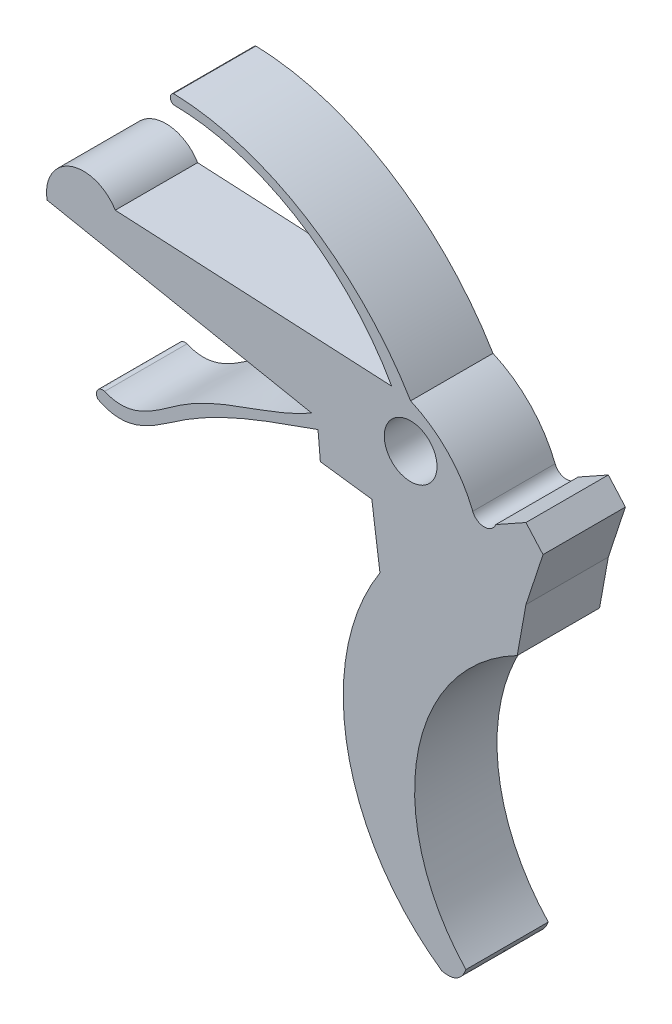
ISO-10303-21;
HEADER;
FILE_DESCRIPTION(('STEP AP214'),'2;1');
FILE_NAME('part.step','',(''),(''),'','','');
FILE_SCHEMA(('AUTOMOTIVE_DESIGN { 1 0 10303 214 1 1 1 1 }'));
ENDSEC;
DATA;
#1=APPLICATION_CONTEXT('core data for automotive mechanical design processes');
#2=APPLICATION_PROTOCOL_DEFINITION('international standard','automotive_design',2000,#1);
#3=PRODUCT_CONTEXT('',#1,'mechanical');
#4=PRODUCT('Part','Part','',(#3));
#5=PRODUCT_RELATED_PRODUCT_CATEGORY('part','',(#4));
#6=PRODUCT_DEFINITION_FORMATION('','',#4);
#7=PRODUCT_DEFINITION_CONTEXT('part definition',#1,'design');
#8=PRODUCT_DEFINITION('design','',#6,#7);
#9=PRODUCT_DEFINITION_SHAPE('','',#8);
#10=(LENGTH_UNIT() NAMED_UNIT(*) SI_UNIT(.MILLI.,.METRE.));
#11=(NAMED_UNIT(*) PLANE_ANGLE_UNIT() SI_UNIT($,.RADIAN.));
#12=(NAMED_UNIT(*) SI_UNIT($,.STERADIAN.) SOLID_ANGLE_UNIT());
#13=UNCERTAINTY_MEASURE_WITH_UNIT(LENGTH_MEASURE(1.E-05),#10,'distance_accuracy_value','');
#14=(GEOMETRIC_REPRESENTATION_CONTEXT(3) GLOBAL_UNCERTAINTY_ASSIGNED_CONTEXT((#13)) GLOBAL_UNIT_ASSIGNED_CONTEXT((#10,
#11,#12)) REPRESENTATION_CONTEXT('',''));
#15=CARTESIAN_POINT('',(0.,0.,0.));
#16=DIRECTION('',(0.,0.,1.));
#17=DIRECTION('',(1.,0.,0.));
#18=AXIS2_PLACEMENT_3D('',#15,#16,#17);
#19=CARTESIAN_POINT('',(37.3818337349311,23.7795758138478,5.));
#20=DIRECTION('',(0.,0.,-1.));
#21=DIRECTION('',(-1.,0.,0.));
#22=AXIS2_PLACEMENT_3D('',#19,#20,#21);
#23=CYLINDRICAL_SURFACE('',#22,7.14654999473033);
#24=CARTESIAN_POINT('',(37.3818337349311,23.7795758138478,0.));
#25=DIRECTION('',(0.,0.,1.));
#26=DIRECTION('',(1.,0.,0.));
#27=AXIS2_PLACEMENT_3D('',#24,#25,#26);
#28=CIRCLE('',#27,7.14654999473033);
#29=CARTESIAN_POINT('',(44.0293534154959,26.4032486066488,0.));
#30=VERTEX_POINT('',#29);
#31=CARTESIAN_POINT('',(40.2574429635764,30.322056107384,0.));
#32=VERTEX_POINT('',#31);
#33=EDGE_CURVE('E215',#30,#32,#28,.T.);
#34=ORIENTED_EDGE('',*,*,#33,.T.);
#35=DIRECTION('',(0.,0.,-1.));
#36=VECTOR('',#35,1.);
#37=CARTESIAN_POINT('',(40.2574429635764,30.322056107384,5.));
#38=LINE('',#37,#36);
#39=CARTESIAN_POINT('',(40.2574429635764,30.322056107384,5.));
#40=VERTEX_POINT('',#39);
#41=EDGE_CURVE('E11',#40,#32,#38,.T.);
#42=ORIENTED_EDGE('',*,*,#41,.F.);
#43=CARTESIAN_POINT('',(37.3818337349311,23.7795758138478,5.));
#44=DIRECTION('',(0.,0.,1.));
#45=DIRECTION('',(1.,0.,0.));
#46=AXIS2_PLACEMENT_3D('',#43,#44,#45);
#47=CIRCLE('',#46,7.14654999473033);
#48=CARTESIAN_POINT('',(44.0293534154959,26.4032486066488,5.));
#49=VERTEX_POINT('',#48);
#50=EDGE_CURVE('E377',#49,#40,#47,.T.);
#51=ORIENTED_EDGE('',*,*,#50,.F.);
#52=DIRECTION('',(0.,0.,-1.));
#53=VECTOR('',#52,1.);
#54=CARTESIAN_POINT('',(44.0293534154959,26.4032486066488,5.));
#55=LINE('',#54,#53);
#56=EDGE_CURVE('E53',#49,#30,#55,.T.);
#57=ORIENTED_EDGE('',*,*,#56,.T.);
#58=EDGE_LOOP('',(#34,#42,#51,#57));
#59=FACE_BOUND('',#58,.T.);
#60=ADVANCED_FACE('F36',(#59),#23,.T.);
#61=CARTESIAN_POINT('',(40.2574429635764,30.322056107384,5.));
#62=CARTESIAN_POINT('',(37.2545948761089,35.3386603093934,5.));
#63=CARTESIAN_POINT('',(31.8347830823189,39.1180125760632,5.));
#64=CARTESIAN_POINT('',(25.8602131568734,39.2785286389903,5.));
#65=B_SPLINE_CURVE_WITH_KNOTS('',3,(#61,#62,#63,#64),.UNSPECIFIED.,.F.,.F.,(4,4),(0.,1.),.UNSPECIFIED.);
#66=DIRECTION('',(0.,0.,-1.));
#67=VECTOR('',#66,1.);
#68=SURFACE_OF_LINEAR_EXTRUSION('',#65,#67);
#69=CARTESIAN_POINT('',(40.2574429635764,30.322056107384,0.));
#70=CARTESIAN_POINT('',(37.2545948761089,35.3386603093934,0.));
#71=CARTESIAN_POINT('',(31.8347830823189,39.1180125760632,0.));
#72=CARTESIAN_POINT('',(25.8602131568734,39.2785286389903,0.));
#73=B_SPLINE_CURVE_WITH_KNOTS('',3,(#69,#70,#71,#72),.UNSPECIFIED.,.F.,.F.,(4,4),(0.,1.),.UNSPECIFIED.);
#74=CARTESIAN_POINT('',(25.8602131568734,39.2785286389903,0.));
#75=VERTEX_POINT('',#74);
#76=EDGE_CURVE('E217',#32,#75,#73,.T.);
#77=ORIENTED_EDGE('',*,*,#76,.T.);
#78=DIRECTION('',(0.,0.,-1.));
#79=VECTOR('',#78,1.);
#80=CARTESIAN_POINT('',(25.8602131568734,39.2785286389903,5.));
#81=LINE('',#80,#79);
#82=CARTESIAN_POINT('',(25.8602131568734,39.2785286389903,5.));
#83=VERTEX_POINT('',#82);
#84=EDGE_CURVE('E45',#83,#75,#81,.T.);
#85=ORIENTED_EDGE('',*,*,#84,.F.);
#86=EDGE_CURVE('E130',#40,#83,#65,.T.);
#87=ORIENTED_EDGE('',*,*,#86,.F.);
#88=ORIENTED_EDGE('',*,*,#41,.T.);
#89=EDGE_LOOP('',(#77,#85,#87,#88));
#90=FACE_BOUND('',#89,.T.);
#91=ADVANCED_FACE('F371',(#90),#68,.F.);
#92=CARTESIAN_POINT('',(25.9867350178914,38.9856572484438,5.));
#93=DIRECTION('',(0.,0.,-1.));
#94=DIRECTION('',(-1.,0.,0.));
#95=AXIS2_PLACEMENT_3D('',#92,#93,#94);
#96=CYLINDRICAL_SURFACE('',#95,0.319032024593247);
#97=CARTESIAN_POINT('',(25.9867350178914,38.9856572484438,0.));
#98=DIRECTION('',(0.,0.,1.));
#99=DIRECTION('',(1.,0.,0.));
#100=AXIS2_PLACEMENT_3D('',#97,#98,#99);
#101=CIRCLE('',#100,0.319032024593247);
#102=CARTESIAN_POINT('',(25.8602131568734,38.6927858578974,0.));
#103=VERTEX_POINT('',#102);
#104=EDGE_CURVE('E221',#75,#103,#101,.T.);
#105=ORIENTED_EDGE('',*,*,#104,.T.);
#106=DIRECTION('',(0.,0.,-1.));
#107=VECTOR('',#106,1.);
#108=CARTESIAN_POINT('',(25.8602131568734,38.6927858578974,5.));
#109=LINE('',#108,#107);
#110=CARTESIAN_POINT('',(25.8602131568734,38.6927858578974,5.));
#111=VERTEX_POINT('',#110);
#112=EDGE_CURVE('E330',#111,#103,#109,.T.);
#113=ORIENTED_EDGE('',*,*,#112,.F.);
#114=CARTESIAN_POINT('',(25.9867350178914,38.9856572484438,5.));
#115=DIRECTION('',(0.,0.,1.));
#116=DIRECTION('',(1.,0.,0.));
#117=AXIS2_PLACEMENT_3D('',#114,#115,#116);
#118=CIRCLE('',#117,0.319032024593247);
#119=EDGE_CURVE('E337',#83,#111,#118,.T.);
#120=ORIENTED_EDGE('',*,*,#119,.F.);
#121=ORIENTED_EDGE('',*,*,#84,.T.);
#122=EDGE_LOOP('',(#105,#113,#120,#121));
#123=FACE_BOUND('',#122,.T.);
#124=ADVANCED_FACE('F335',(#123),#96,.T.);
#125=CARTESIAN_POINT('',(39.110435040759,30.5197055701568,5.));
#126=CARTESIAN_POINT('',(36.470361769885,35.234015670945,5.));
#127=CARTESIAN_POINT('',(31.363758289211,38.6342021007757,5.));
#128=CARTESIAN_POINT('',(25.8602131568734,38.6927858578974,5.));
#129=B_SPLINE_CURVE_WITH_KNOTS('',3,(#125,#126,#127,#128),.UNSPECIFIED.,.F.,.F.,(4,4),(0.,1.),.UNSPECIFIED.);
#130=DIRECTION('',(0.,0.,-1.));
#131=VECTOR('',#130,1.);
#132=SURFACE_OF_LINEAR_EXTRUSION('',#129,#131);
#133=CARTESIAN_POINT('',(39.110435040759,30.5197055701568,0.));
#134=CARTESIAN_POINT('',(36.470361769885,35.234015670945,0.));
#135=CARTESIAN_POINT('',(31.363758289211,38.6342021007757,0.));
#136=CARTESIAN_POINT('',(25.8602131568734,38.6927858578974,0.));
#137=B_SPLINE_CURVE_WITH_KNOTS('',3,(#133,#134,#135,#136),.UNSPECIFIED.,.F.,.F.,(4,4),(0.,1.),.UNSPECIFIED.);
#138=CARTESIAN_POINT('',(39.110435040759,30.5197055701568,0.));
#139=VERTEX_POINT('',#138);
#140=EDGE_CURVE('E227',#139,#103,#137,.T.);
#141=ORIENTED_EDGE('',*,*,#140,.F.);
#142=DIRECTION('',(0.,0.,-1.));
#143=VECTOR('',#142,1.);
#144=CARTESIAN_POINT('',(39.110435040759,30.5197055701568,5.));
#145=LINE('',#144,#143);
#146=CARTESIAN_POINT('',(39.110435040759,30.5197055701568,5.));
#147=VERTEX_POINT('',#146);
#148=EDGE_CURVE('E328',#147,#139,#145,.T.);
#149=ORIENTED_EDGE('',*,*,#148,.F.);
#150=EDGE_CURVE('E347',#147,#111,#129,.T.);
#151=ORIENTED_EDGE('',*,*,#150,.T.);
#152=ORIENTED_EDGE('',*,*,#112,.T.);
#153=EDGE_LOOP('',(#141,#149,#151,#152));
#154=FACE_BOUND('',#153,.T.);
#155=ADVANCED_FACE('F344',(#154),#132,.T.);
#156=CARTESIAN_POINT('',(1.6619992772925,32.4383969666114,5.));
#157=DIRECTION('',(0.0511684385078754,0.998690037449391,0.));
#158=DIRECTION('',(-0.998690037449391,0.0511684385078754,0.));
#159=AXIS2_PLACEMENT_3D('',#156,#157,#158);
#160=PLANE('',#159);
#161=DIRECTION('',(0.998690037449391,-0.0511684385078754,0.));
#162=VECTOR('',#161,1.);
#163=CARTESIAN_POINT('',(1.6619992772925,32.4383969666114,0.));
#164=LINE('',#163,#162);
#165=CARTESIAN_POINT('',(22.327201908344,31.3796038371832,0.));
#166=VERTEX_POINT('',#165);
#167=EDGE_CURVE('E232',#166,#139,#164,.T.);
#168=ORIENTED_EDGE('',*,*,#167,.F.);
#169=DIRECTION('',(0.,0.,-1.));
#170=VECTOR('',#169,1.);
#171=CARTESIAN_POINT('',(22.327201908344,31.3796038371832,5.));
#172=LINE('',#171,#170);
#173=CARTESIAN_POINT('',(22.327201908344,31.3796038371832,5.));
#174=VERTEX_POINT('',#173);
#175=EDGE_CURVE('E326',#174,#166,#172,.T.);
#176=ORIENTED_EDGE('',*,*,#175,.F.);
#177=DIRECTION('',(0.998690037449391,-0.0511684385078754,0.));
#178=VECTOR('',#177,1.);
#179=CARTESIAN_POINT('',(1.6619992772925,32.4383969666114,5.));
#180=LINE('',#179,#178);
#181=EDGE_CURVE('E350',#174,#147,#180,.T.);
#182=ORIENTED_EDGE('',*,*,#181,.T.);
#183=ORIENTED_EDGE('',*,*,#148,.T.);
#184=EDGE_LOOP('',(#168,#176,#182,#183));
#185=FACE_BOUND('',#184,.T.);
#186=ADVANCED_FACE('F367',(#185),#160,.T.);
#187=CARTESIAN_POINT('',(20.4014032915097,30.2309320198475,5.));
#188=DIRECTION('',(0.,0.,-1.));
#189=DIRECTION('',(-1.,0.,0.));
#190=AXIS2_PLACEMENT_3D('',#187,#188,#189);
#191=CYLINDRICAL_SURFACE('',#190,2.24235306241949);
#192=CARTESIAN_POINT('',(20.4014032915097,30.2309320198475,0.));
#193=DIRECTION('',(0.,0.,1.));
#194=DIRECTION('',(1.,0.,0.));
#195=AXIS2_PLACEMENT_3D('',#192,#193,#194);
#196=CIRCLE('',#195,2.24235306241949);
#197=CARTESIAN_POINT('',(18.1931516918561,29.8413525938389,0.));
#198=VERTEX_POINT('',#197);
#199=EDGE_CURVE('E238',#166,#198,#196,.T.);
#200=ORIENTED_EDGE('',*,*,#199,.T.);
#201=DIRECTION('',(0.,0.,-1.));
#202=VECTOR('',#201,1.);
#203=CARTESIAN_POINT('',(18.1931516918561,29.8413525938389,5.));
#204=LINE('',#203,#202);
#205=CARTESIAN_POINT('',(18.1931516918561,29.8413525938389,5.));
#206=VERTEX_POINT('',#205);
#207=EDGE_CURVE('E323',#206,#198,#204,.T.);
#208=ORIENTED_EDGE('',*,*,#207,.F.);
#209=CARTESIAN_POINT('',(20.4014032915097,30.2309320198475,5.));
#210=DIRECTION('',(0.,0.,1.));
#211=DIRECTION('',(1.,0.,0.));
#212=AXIS2_PLACEMENT_3D('',#209,#210,#211);
#213=CIRCLE('',#212,2.24235306241949);
#214=EDGE_CURVE('E352',#174,#206,#213,.T.);
#215=ORIENTED_EDGE('',*,*,#214,.F.);
#216=ORIENTED_EDGE('',*,*,#175,.T.);
#217=EDGE_LOOP('',(#200,#208,#215,#216));
#218=FACE_BOUND('',#217,.T.);
#219=ADVANCED_FACE('F472',(#218),#191,.T.);
#220=CARTESIAN_POINT('',(6.33637133537671,32.1762708777534,5.));
#221=DIRECTION('',(0.19321599860004,0.981156245398759,0.));
#222=DIRECTION('',(-0.981156245398759,0.19321599860004,0.));
#223=AXIS2_PLACEMENT_3D('',#220,#221,#222);
#224=PLANE('',#223);
#225=DIRECTION('',(0.981156245398759,-0.19321599860004,0.));
#226=VECTOR('',#225,1.);
#227=CARTESIAN_POINT('',(6.33637133537671,32.1762708777534,0.));
#228=LINE('',#227,#226);
#229=CARTESIAN_POINT('',(34.2534981984501,26.678639312762,0.));
#230=VERTEX_POINT('',#229);
#231=EDGE_CURVE('E240',#198,#230,#228,.T.);
#232=ORIENTED_EDGE('',*,*,#231,.T.);
#233=DIRECTION('',(0.,0.,-1.));
#234=VECTOR('',#233,1.);
#235=CARTESIAN_POINT('',(34.2534981984501,26.678639312762,5.));
#236=LINE('',#235,#234);
#237=CARTESIAN_POINT('',(34.2534981984501,26.678639312762,5.));
#238=VERTEX_POINT('',#237);
#239=EDGE_CURVE('E320',#238,#230,#236,.T.);
#240=ORIENTED_EDGE('',*,*,#239,.F.);
#241=DIRECTION('',(0.981156245398759,-0.19321599860004,0.));
#242=VECTOR('',#241,1.);
#243=CARTESIAN_POINT('',(6.33637133537671,32.1762708777534,5.));
#244=LINE('',#243,#242);
#245=EDGE_CURVE('E467',#206,#238,#244,.T.);
#246=ORIENTED_EDGE('',*,*,#245,.F.);
#247=ORIENTED_EDGE('',*,*,#207,.T.);
#248=EDGE_LOOP('',(#232,#240,#246,#247));
#249=FACE_BOUND('',#248,.T.);
#250=ADVANCED_FACE('F466',(#249),#224,.F.);
#251=CARTESIAN_POINT('',(34.2534981984501,26.678639312762,5.));
#252=CARTESIAN_POINT('',(31.6637874763804,25.1921338439413,5.));
#253=CARTESIAN_POINT('',(27.2829957958831,24.6024625937999,5.));
#254=CARTESIAN_POINT('',(23.4719266528236,20.7844869531401,5.));
#255=CARTESIAN_POINT('',(21.6844335803834,21.5348725030533,5.));
#256=B_SPLINE_CURVE_WITH_KNOTS('',3,(#251,#252,#253,#254,#255),.UNSPECIFIED.,.F.,.F.,(4,1,4),
(0.,0.618454584909698,1.),.UNSPECIFIED.);
#257=DIRECTION('',(0.,0.,-1.));
#258=VECTOR('',#257,1.);
#259=SURFACE_OF_LINEAR_EXTRUSION('',#256,#258);
#260=CARTESIAN_POINT('',(34.2534981984501,26.678639312762,0.));
#261=CARTESIAN_POINT('',(31.6637874763804,25.1921338439413,0.));
#262=CARTESIAN_POINT('',(27.2829957958831,24.6024625937999,0.));
#263=CARTESIAN_POINT('',(23.4719266528236,20.7844869531401,0.));
#264=CARTESIAN_POINT('',(21.6844335803834,21.5348725030533,0.));
#265=B_SPLINE_CURVE_WITH_KNOTS('',3,(#260,#261,#262,#263,#264),.UNSPECIFIED.,.F.,.F.,(4,1,4),
(0.,0.618454584909698,1.),.UNSPECIFIED.);
#266=CARTESIAN_POINT('',(21.6844335803834,21.5348725030533,0.));
#267=VERTEX_POINT('',#266);
#268=EDGE_CURVE('E242',#230,#267,#265,.T.);
#269=ORIENTED_EDGE('',*,*,#268,.T.);
#270=DIRECTION('',(0.,0.,-1.));
#271=VECTOR('',#270,1.);
#272=CARTESIAN_POINT('',(21.6844335803834,21.5348725030533,5.));
#273=LINE('',#272,#271);
#274=CARTESIAN_POINT('',(21.6844335803834,21.5348725030533,5.));
#275=VERTEX_POINT('',#274);
#276=EDGE_CURVE('E317',#275,#267,#273,.T.);
#277=ORIENTED_EDGE('',*,*,#276,.F.);
#278=EDGE_CURVE('E462',#238,#275,#256,.T.);
#279=ORIENTED_EDGE('',*,*,#278,.F.);
#280=ORIENTED_EDGE('',*,*,#239,.T.);
#281=EDGE_LOOP('',(#269,#277,#279,#280));
#282=FACE_BOUND('',#281,.T.);
#283=ADVANCED_FACE('F461',(#282),#259,.F.);
#284=CARTESIAN_POINT('',(21.5657637111525,21.1714144072318,5.));
#285=DIRECTION('',(0.,0.,-1.));
#286=DIRECTION('',(-1.,0.,0.));
#287=AXIS2_PLACEMENT_3D('',#284,#285,#286);
#288=CYLINDRICAL_SURFACE('',#287,0.382340588064524);
#289=CARTESIAN_POINT('',(21.5657637111525,21.1714144072318,0.));
#290=DIRECTION('',(0.,0.,1.));
#291=DIRECTION('',(1.,0.,0.));
#292=AXIS2_PLACEMENT_3D('',#289,#290,#291);
#293=CIRCLE('',#292,0.382340588064524);
#294=CARTESIAN_POINT('',(21.2795499589186,20.9179069846308,0.));
#295=VERTEX_POINT('',#294);
#296=EDGE_CURVE('E246',#267,#295,#293,.T.);
#297=ORIENTED_EDGE('',*,*,#296,.T.);
#298=DIRECTION('',(0.,0.,-1.));
#299=VECTOR('',#298,1.);
#300=CARTESIAN_POINT('',(21.2795499589186,20.9179069846308,5.));
#301=LINE('',#300,#299);
#302=CARTESIAN_POINT('',(21.2795499589186,20.9179069846308,5.));
#303=VERTEX_POINT('',#302);
#304=EDGE_CURVE('E315',#303,#295,#301,.T.);
#305=ORIENTED_EDGE('',*,*,#304,.F.);
#306=CARTESIAN_POINT('',(21.5657637111525,21.1714144072318,5.));
#307=DIRECTION('',(0.,0.,1.));
#308=DIRECTION('',(1.,0.,0.));
#309=AXIS2_PLACEMENT_3D('',#306,#307,#308);
#310=CIRCLE('',#309,0.382340588064524);
#311=EDGE_CURVE('E458',#275,#303,#310,.T.);
#312=ORIENTED_EDGE('',*,*,#311,.F.);
#313=ORIENTED_EDGE('',*,*,#276,.T.);
#314=EDGE_LOOP('',(#297,#305,#312,#313));
#315=FACE_BOUND('',#314,.T.);
#316=ADVANCED_FACE('F455',(#315),#288,.T.);
#317=CARTESIAN_POINT('',(34.6368329298013,26.0047111622717,5.));
#318=CARTESIAN_POINT('',(31.6672221262085,24.9414673210866,5.));
#319=CARTESIAN_POINT('',(27.3105156230599,23.52490171578,5.));
#320=CARTESIAN_POINT('',(23.1726418907745,19.9220567977232,5.));
#321=CARTESIAN_POINT('',(21.2795499589186,20.9179069846308,5.));
#322=B_SPLINE_CURVE_WITH_KNOTS('',3,(#317,#318,#319,#320,#321),.UNSPECIFIED.,.F.,.F.,(4,1,4),
(0.,0.624834993908193,1.),.UNSPECIFIED.);
#323=DIRECTION('',(0.,0.,-1.));
#324=VECTOR('',#323,1.);
#325=SURFACE_OF_LINEAR_EXTRUSION('',#322,#324);
#326=CARTESIAN_POINT('',(34.6368329298013,26.0047111622717,0.));
#327=CARTESIAN_POINT('',(31.6672221262085,24.9414673210866,0.));
#328=CARTESIAN_POINT('',(27.3105156230599,23.52490171578,0.));
#329=CARTESIAN_POINT('',(23.1726418907745,19.9220567977232,0.));
#330=CARTESIAN_POINT('',(21.2795499589186,20.9179069846308,0.));
#331=B_SPLINE_CURVE_WITH_KNOTS('',3,(#326,#327,#328,#329,#330),.UNSPECIFIED.,.F.,.F.,(4,1,4),
(0.,0.624834993908193,1.),.UNSPECIFIED.);
#332=CARTESIAN_POINT('',(34.6368329298013,26.0047111622717,0.));
#333=VERTEX_POINT('',#332);
#334=EDGE_CURVE('E252',#333,#295,#331,.T.);
#335=ORIENTED_EDGE('',*,*,#334,.F.);
#336=DIRECTION('',(0.,0.,-1.));
#337=VECTOR('',#336,1.);
#338=CARTESIAN_POINT('',(34.6368329298013,26.0047111622717,5.));
#339=LINE('',#338,#337);
#340=CARTESIAN_POINT('',(34.6368329298013,26.0047111622717,5.));
#341=VERTEX_POINT('',#340);
#342=EDGE_CURVE('E313',#341,#333,#339,.T.);
#343=ORIENTED_EDGE('',*,*,#342,.F.);
#344=EDGE_CURVE('E449',#341,#303,#322,.T.);
#345=ORIENTED_EDGE('',*,*,#344,.T.);
#346=ORIENTED_EDGE('',*,*,#304,.T.);
#347=EDGE_LOOP('',(#335,#343,#345,#346));
#348=FACE_BOUND('',#347,.T.);
#349=ADVANCED_FACE('F448',(#348),#325,.T.);
#350=CARTESIAN_POINT('',(36.6185248319001,3.17918824406419,5.));
#351=DIRECTION('',(0.996252392469126,0.0864937598878781,0.));
#352=DIRECTION('',(-0.0864937598878781,0.996252392469126,0.));
#353=AXIS2_PLACEMENT_3D('',#350,#351,#352);
#354=PLANE('',#353);
#355=DIRECTION('',(0.0864937598878781,-0.996252392469126,0.));
#356=VECTOR('',#355,1.);
#357=CARTESIAN_POINT('',(36.6185248319001,3.17918824406419,0.));
#358=LINE('',#357,#356);
#359=CARTESIAN_POINT('',(34.7774229091622,24.385367715102,0.));
#360=VERTEX_POINT('',#359);
#361=EDGE_CURVE('E257',#333,#360,#358,.T.);
#362=ORIENTED_EDGE('',*,*,#361,.T.);
#363=DIRECTION('',(0.,0.,-1.));
#364=VECTOR('',#363,1.);
#365=CARTESIAN_POINT('',(34.7774229091622,24.385367715102,5.));
#366=LINE('',#365,#364);
#367=CARTESIAN_POINT('',(34.7774229091622,24.385367715102,5.));
#368=VERTEX_POINT('',#367);
#369=EDGE_CURVE('E310',#368,#360,#366,.T.);
#370=ORIENTED_EDGE('',*,*,#369,.F.);
#371=DIRECTION('',(0.0864937598878781,-0.996252392469126,0.));
#372=VECTOR('',#371,1.);
#373=CARTESIAN_POINT('',(36.6185248319001,3.17918824406419,5.));
#374=LINE('',#373,#372);
#375=EDGE_CURVE('E444',#341,#368,#374,.T.);
#376=ORIENTED_EDGE('',*,*,#375,.F.);
#377=ORIENTED_EDGE('',*,*,#342,.T.);
#378=EDGE_LOOP('',(#362,#370,#376,#377));
#379=FACE_BOUND('',#378,.T.);
#380=ADVANCED_FACE('F443',(#379),#354,.F.);
#381=CARTESIAN_POINT('',(3.71995682536061,28.4467286645222,5.));
#382=DIRECTION('',(0.129665254140665,0.991557825781551,0.));
#383=DIRECTION('',(-0.991557825781551,0.129665254140665,0.));
#384=AXIS2_PLACEMENT_3D('',#381,#382,#383);
#385=PLANE('',#384);
#386=DIRECTION('',(0.991557825781551,-0.129665254140665,0.));
#387=VECTOR('',#386,1.);
#388=CARTESIAN_POINT('',(3.71995682536061,28.4467286645222,0.));
#389=LINE('',#388,#387);
#390=CARTESIAN_POINT('',(37.9019957472054,23.9767697285886,0.));
#391=VERTEX_POINT('',#390);
#392=EDGE_CURVE('E262',#360,#391,#389,.T.);
#393=ORIENTED_EDGE('',*,*,#392,.T.);
#394=DIRECTION('',(0.,0.,-1.));
#395=VECTOR('',#394,1.);
#396=CARTESIAN_POINT('',(37.9019957472054,23.9767697285886,5.));
#397=LINE('',#396,#395);
#398=CARTESIAN_POINT('',(37.9019957472054,23.9767697285886,5.));
#399=VERTEX_POINT('',#398);
#400=EDGE_CURVE('E307',#399,#391,#397,.T.);
#401=ORIENTED_EDGE('',*,*,#400,.F.);
#402=DIRECTION('',(0.991557825781551,-0.129665254140665,0.));
#403=VECTOR('',#402,1.);
#404=CARTESIAN_POINT('',(3.71995682536061,28.4467286645222,5.));
#405=LINE('',#404,#403);
#406=EDGE_CURVE('E440',#368,#399,#405,.T.);
#407=ORIENTED_EDGE('',*,*,#406,.F.);
#408=ORIENTED_EDGE('',*,*,#369,.T.);
#409=EDGE_LOOP('',(#393,#401,#407,#408));
#410=FACE_BOUND('',#409,.T.);
#411=ADVANCED_FACE('F437',(#410),#385,.F.);
#412=CARTESIAN_POINT('',(40.4144228043435,5.4935344193503,5.));
#413=DIRECTION('',(0.990887595677202,0.134691398140541,0.));
#414=DIRECTION('',(-0.134691398140541,0.990887595677202,0.));
#415=AXIS2_PLACEMENT_3D('',#412,#413,#414);
#416=PLANE('',#415);
#417=DIRECTION('',(0.134691398140541,-0.990887595677202,0.));
#418=VECTOR('',#417,1.);
#419=CARTESIAN_POINT('',(40.4144228043435,5.4935344193503,0.));
#420=LINE('',#419,#418);
#421=CARTESIAN_POINT('',(38.3951975521026,20.3484196083502,0.));
#422=VERTEX_POINT('',#421);
#423=EDGE_CURVE('E264',#391,#422,#420,.T.);
#424=ORIENTED_EDGE('',*,*,#423,.T.);
#425=DIRECTION('',(0.,0.,-1.));
#426=VECTOR('',#425,1.);
#427=CARTESIAN_POINT('',(38.3951975521026,20.3484196083502,5.));
#428=LINE('',#427,#426);
#429=CARTESIAN_POINT('',(38.3951975521026,20.3484196083502,5.));
#430=VERTEX_POINT('',#429);
#431=EDGE_CURVE('E304',#430,#422,#428,.T.);
#432=ORIENTED_EDGE('',*,*,#431,.F.);
#433=DIRECTION('',(0.134691398140541,-0.990887595677202,0.));
#434=VECTOR('',#433,1.);
#435=CARTESIAN_POINT('',(40.4144228043435,5.4935344193503,5.));
#436=LINE('',#435,#434);
#437=EDGE_CURVE('E431',#399,#430,#436,.T.);
#438=ORIENTED_EDGE('',*,*,#437,.F.);
#439=ORIENTED_EDGE('',*,*,#400,.T.);
#440=EDGE_LOOP('',(#424,#432,#438,#439));
#441=FACE_BOUND('',#440,.T.);
#442=ADVANCED_FACE('F430',(#441),#416,.F.);
#443=CARTESIAN_POINT('',(50.154117951621,12.7771348691759,5.));
#444=DIRECTION('',(0.,0.,-1.));
#445=DIRECTION('',(-1.,0.,0.));
#446=AXIS2_PLACEMENT_3D('',#443,#444,#445);
#447=CYLINDRICAL_SURFACE('',#446,13.9855840623072);
#448=CARTESIAN_POINT('',(50.154117951621,12.7771348691759,0.));
#449=DIRECTION('',(0.,0.,1.));
#450=DIRECTION('',(1.,0.,0.));
#451=AXIS2_PLACEMENT_3D('',#448,#449,#450);
#452=CIRCLE('',#451,13.9855840623072);
#453=CARTESIAN_POINT('',(42.1532754100675,1.30616803158411,0.));
#454=VERTEX_POINT('',#453);
#455=EDGE_CURVE('E266',#422,#454,#452,.T.);
#456=ORIENTED_EDGE('',*,*,#455,.T.);
#457=DIRECTION('',(0.,0.,-1.));
#458=VECTOR('',#457,1.);
#459=CARTESIAN_POINT('',(42.1532754100675,1.30616803158411,5.));
#460=LINE('',#459,#458);
#461=CARTESIAN_POINT('',(42.1532754100675,1.30616803158411,5.));
#462=VERTEX_POINT('',#461);
#463=EDGE_CURVE('E301',#462,#454,#460,.T.);
#464=ORIENTED_EDGE('',*,*,#463,.F.);
#465=CARTESIAN_POINT('',(50.154117951621,12.7771348691759,5.));
#466=DIRECTION('',(0.,0.,1.));
#467=DIRECTION('',(1.,0.,0.));
#468=AXIS2_PLACEMENT_3D('',#465,#466,#467);
#469=CIRCLE('',#468,13.9855840623072);
#470=EDGE_CURVE('E426',#430,#462,#469,.T.);
#471=ORIENTED_EDGE('',*,*,#470,.F.);
#472=ORIENTED_EDGE('',*,*,#431,.T.);
#473=EDGE_LOOP('',(#456,#464,#471,#472));
#474=FACE_BOUND('',#473,.T.);
#475=ADVANCED_FACE('F425',(#474),#447,.T.);
#476=CARTESIAN_POINT('',(42.1532754100675,1.30616803158412,5.));
#477=CARTESIAN_POINT('',(43.2161155265381,1.05807474595941,5.));
#478=CARTESIAN_POINT('',(43.6123576956384,2.10461825840639,5.));
#479=B_SPLINE_CURVE_WITH_KNOTS('',2,(#476,#477,#478),.UNSPECIFIED.,.F.,.F.,(3,3),(0.,1.),.UNSPECIFIED.);
#480=DIRECTION('',(0.,0.,-1.));
#481=VECTOR('',#480,1.);
#482=SURFACE_OF_LINEAR_EXTRUSION('',#479,#481);
#483=CARTESIAN_POINT('',(42.1532754100675,1.30616803158412,0.));
#484=CARTESIAN_POINT('',(43.2161155265381,1.05807474595941,0.));
#485=CARTESIAN_POINT('',(43.6123576956384,2.10461825840639,0.));
#486=B_SPLINE_CURVE_WITH_KNOTS('',2,(#483,#484,#485),.UNSPECIFIED.,.F.,.F.,(3,3),(0.,1.),.UNSPECIFIED.);
#487=CARTESIAN_POINT('',(43.6123576956384,2.10461825840639,0.));
#488=VERTEX_POINT('',#487);
#489=EDGE_CURVE('E268',#454,#488,#486,.T.);
#490=ORIENTED_EDGE('',*,*,#489,.T.);
#491=DIRECTION('',(0.,0.,-1.));
#492=VECTOR('',#491,1.);
#493=CARTESIAN_POINT('',(43.6123576956384,2.10461825840639,5.));
#494=LINE('',#493,#492);
#495=CARTESIAN_POINT('',(43.6123576956384,2.10461825840639,5.));
#496=VERTEX_POINT('',#495);
#497=EDGE_CURVE('E299',#496,#488,#494,.T.);
#498=ORIENTED_EDGE('',*,*,#497,.F.);
#499=EDGE_CURVE('E422',#462,#496,#479,.T.);
#500=ORIENTED_EDGE('',*,*,#499,.F.);
#501=ORIENTED_EDGE('',*,*,#463,.T.);
#502=EDGE_LOOP('',(#490,#498,#500,#501));
#503=FACE_BOUND('',#502,.T.);
#504=ADVANCED_FACE('F419',(#503),#482,.F.);
#505=CARTESIAN_POINT('',(51.9793612179416,9.9628943637883,5.));
#506=DIRECTION('',(0.,0.,-1.));
#507=DIRECTION('',(-1.,0.,0.));
#508=AXIS2_PLACEMENT_3D('',#505,#506,#507);
#509=CYLINDRICAL_SURFACE('',#508,11.4786432687253);
#510=CARTESIAN_POINT('',(51.9793612179416,9.9628943637883,0.));
#511=DIRECTION('',(0.,0.,1.));
#512=DIRECTION('',(1.,0.,0.));
#513=AXIS2_PLACEMENT_3D('',#510,#511,#512);
#514=CIRCLE('',#513,11.4786432687253);
#515=CARTESIAN_POINT('',(46.7268537291453,20.1692853209676,0.));
#516=VERTEX_POINT('',#515);
#517=EDGE_CURVE('E273',#516,#488,#514,.T.);
#518=ORIENTED_EDGE('',*,*,#517,.F.);
#519=DIRECTION('',(0.,0.,-1.));
#520=VECTOR('',#519,1.);
#521=CARTESIAN_POINT('',(46.7268537291453,20.1692853209676,5.));
#522=LINE('',#521,#520);
#523=CARTESIAN_POINT('',(46.7268537291453,20.1692853209676,5.));
#524=VERTEX_POINT('',#523);
#525=EDGE_CURVE('E297',#524,#516,#522,.T.);
#526=ORIENTED_EDGE('',*,*,#525,.F.);
#527=CARTESIAN_POINT('',(51.9793612179416,9.9628943637883,5.));
#528=DIRECTION('',(0.,0.,1.));
#529=DIRECTION('',(1.,0.,0.));
#530=AXIS2_PLACEMENT_3D('',#527,#528,#529);
#531=CIRCLE('',#530,11.4786432687253);
#532=EDGE_CURVE('E520',#524,#496,#531,.T.);
#533=ORIENTED_EDGE('',*,*,#532,.T.);
#534=ORIENTED_EDGE('',*,*,#497,.T.);
#535=EDGE_LOOP('',(#518,#526,#533,#534));
#536=FACE_BOUND('',#535,.T.);
#537=ADVANCED_FACE('F413',(#536),#509,.F.);
#538=CARTESIAN_POINT('',(41.7346595414808,-7.52352426219131,5.));
#539=DIRECTION('',(0.984136891531931,-0.177410762711479,0.));
#540=DIRECTION('',(0.177410762711479,0.984136891531931,0.));
#541=AXIS2_PLACEMENT_3D('',#538,#539,#540);
#542=PLANE('',#541);
#543=DIRECTION('',(-0.177410762711479,-0.984136891531931,0.));
#544=VECTOR('',#543,1.);
#545=CARTESIAN_POINT('',(41.7346595414808,-7.52352426219131,0.));
#546=LINE('',#545,#544);
#547=CARTESIAN_POINT('',(47.2573624616512,23.1121350498079,0.));
#548=VERTEX_POINT('',#547);
#549=EDGE_CURVE('E279',#548,#516,#546,.T.);
#550=ORIENTED_EDGE('',*,*,#549,.F.);
#551=DIRECTION('',(0.,0.,-1.));
#552=VECTOR('',#551,1.);
#553=CARTESIAN_POINT('',(47.2573624616512,23.1121350498079,5.));
#554=LINE('',#553,#552);
#555=CARTESIAN_POINT('',(47.2573624616512,23.1121350498079,5.));
#556=VERTEX_POINT('',#555);
#557=EDGE_CURVE('E295',#556,#548,#554,.T.);
#558=ORIENTED_EDGE('',*,*,#557,.F.);
#559=DIRECTION('',(-0.177410762711479,-0.984136891531931,0.));
#560=VECTOR('',#559,1.);
#561=CARTESIAN_POINT('',(41.7346595414808,-7.52352426219131,5.));
#562=LINE('',#561,#560);
#563=EDGE_CURVE('E409',#556,#524,#562,.T.);
#564=ORIENTED_EDGE('',*,*,#563,.T.);
#565=ORIENTED_EDGE('',*,*,#525,.T.);
#566=EDGE_LOOP('',(#550,#558,#564,#565));
#567=FACE_BOUND('',#566,.T.);
#568=ADVANCED_FACE('F407',(#567),#542,.T.);
#569=CARTESIAN_POINT('',(35.7611375852346,-11.7819010275744,5.));
#570=DIRECTION('',(0.949780876902833,-0.312915780793628,0.));
#571=DIRECTION('',(0.312915780793628,0.949780876902833,0.));
#572=AXIS2_PLACEMENT_3D('',#569,#570,#571);
#573=PLANE('',#572);
#574=DIRECTION('',(-0.312915780793628,-0.949780876902833,0.));
#575=VECTOR('',#574,1.);
#576=CARTESIAN_POINT('',(35.7611375852346,-11.7819010275744,0.));
#577=LINE('',#576,#575);
#578=CARTESIAN_POINT('',(48.2943486877226,26.259658273585,0.));
#579=VERTEX_POINT('',#578);
#580=EDGE_CURVE('E282',#579,#548,#577,.T.);
#581=ORIENTED_EDGE('',*,*,#580,.F.);
#582=DIRECTION('',(0.,0.,-1.));
#583=VECTOR('',#582,1.);
#584=CARTESIAN_POINT('',(48.2943486877226,26.259658273585,5.));
#585=LINE('',#584,#583);
#586=CARTESIAN_POINT('',(48.2943486877226,26.259658273585,5.));
#587=VERTEX_POINT('',#586);
#588=EDGE_CURVE('E194',#587,#579,#585,.T.);
#589=ORIENTED_EDGE('',*,*,#588,.F.);
#590=DIRECTION('',(-0.312915780793628,-0.949780876902833,0.));
#591=VECTOR('',#590,1.);
#592=CARTESIAN_POINT('',(35.7611375852346,-11.7819010275744,5.));
#593=LINE('',#592,#591);
#594=EDGE_CURVE('E204',#587,#556,#593,.T.);
#595=ORIENTED_EDGE('',*,*,#594,.T.);
#596=ORIENTED_EDGE('',*,*,#557,.T.);
#597=EDGE_LOOP('',(#581,#589,#595,#596));
#598=FACE_BOUND('',#597,.T.);
#599=ADVANCED_FACE('F404',(#598),#573,.T.);
#600=CARTESIAN_POINT('',(40.0651801938546,35.5373174323105,5.));
#601=DIRECTION('',(0.748115188582897,0.663568884601724,0.));
#602=DIRECTION('',(-0.663568884601724,0.748115188582897,0.));
#603=AXIS2_PLACEMENT_3D('',#600,#601,#602);
#604=PLANE('',#603);
#605=DIRECTION('',(0.663568884601724,-0.748115188582897,0.));
#606=VECTOR('',#605,1.);
#607=CARTESIAN_POINT('',(40.0651801938546,35.5373174323105,0.));
#608=LINE('',#607,#606);
#609=CARTESIAN_POINT('',(47.2573624616512,27.4287684655749,0.));
#610=VERTEX_POINT('',#609);
#611=EDGE_CURVE('E190',#610,#579,#608,.T.);
#612=ORIENTED_EDGE('',*,*,#611,.F.);
#613=DIRECTION('',(0.,0.,-1.));
#614=VECTOR('',#613,1.);
#615=CARTESIAN_POINT('',(47.2573624616512,27.4287684655749,5.));
#616=LINE('',#615,#614);
#617=CARTESIAN_POINT('',(47.2573624616512,27.4287684655749,5.));
#618=VERTEX_POINT('',#617);
#619=EDGE_CURVE('E185',#618,#610,#616,.T.);
#620=ORIENTED_EDGE('',*,*,#619,.F.);
#621=DIRECTION('',(0.663568884601724,-0.748115188582897,0.));
#622=VECTOR('',#621,1.);
#623=CARTESIAN_POINT('',(40.0651801938546,35.5373174323105,5.));
#624=LINE('',#623,#622);
#625=EDGE_CURVE('E188',#618,#587,#624,.T.);
#626=ORIENTED_EDGE('',*,*,#625,.T.);
#627=ORIENTED_EDGE('',*,*,#588,.T.);
#628=EDGE_LOOP('',(#612,#620,#626,#627));
#629=FACE_BOUND('',#628,.T.);
#630=ADVANCED_FACE('F187',(#629),#604,.T.);
#631=CARTESIAN_POINT('',(-0.418635986947759,0.748064545988115,5.));
#632=DIRECTION('',(-0.488354555114007,0.872645305092167,0.));
#633=DIRECTION('',(-0.872645305092167,-0.488354555114007,0.));
#634=AXIS2_PLACEMENT_3D('',#631,#632,#633);
#635=PLANE('',#634);
#636=DIRECTION('',(0.872645305092167,0.488354555114007,0.));
#637=VECTOR('',#636,1.);
#638=CARTESIAN_POINT('',(-0.418635986947759,0.748064545988115,0.));
#639=LINE('',#638,#637);
#640=CARTESIAN_POINT('',(45.4248514697924,26.4032486066488,0.));
#641=VERTEX_POINT('',#640);
#642=EDGE_CURVE('E286',#641,#610,#639,.T.);
#643=ORIENTED_EDGE('',*,*,#642,.F.);
#644=DIRECTION('',(0.,0.,-1.));
#645=VECTOR('',#644,1.);
#646=CARTESIAN_POINT('',(45.4248514697924,26.4032486066488,5.));
#647=LINE('',#646,#645);
#648=CARTESIAN_POINT('',(45.4248514697924,26.4032486066488,5.));
#649=VERTEX_POINT('',#648);
#650=EDGE_CURVE('E118',#649,#641,#647,.T.);
#651=ORIENTED_EDGE('',*,*,#650,.F.);
#652=DIRECTION('',(0.872645305092167,0.488354555114007,0.));
#653=VECTOR('',#652,1.);
#654=CARTESIAN_POINT('',(-0.418635986947759,0.748064545988115,5.));
#655=LINE('',#654,#653);
#656=EDGE_CURVE('E201',#649,#618,#655,.T.);
#657=ORIENTED_EDGE('',*,*,#656,.T.);
#658=ORIENTED_EDGE('',*,*,#619,.T.);
#659=EDGE_LOOP('',(#643,#651,#657,#658));
#660=FACE_BOUND('',#659,.T.);
#661=ADVANCED_FACE('F206',(#660),#635,.T.);
#662=CARTESIAN_POINT('',(40.2574429635764,27.6738930269316,5.));
#663=DIRECTION('',(0.,0.,-1.));
#664=DIRECTION('',(-1.,0.,0.));
#665=AXIS2_PLACEMENT_3D('',#662,#663,#664);
#666=CYLINDRICAL_SURFACE('',#665,1.6);
#667=CARTESIAN_POINT('',(40.2574429635764,27.6738930269316,5.));
#668=DIRECTION('',(0.,0.,1.));
#669=DIRECTION('',(1.,0.,0.));
#670=AXIS2_PLACEMENT_3D('',#667,#668,#669);
#671=CIRCLE('',#670,1.6);
#672=CARTESIAN_POINT('',(41.8574429635764,27.6738930269316,5.));
#673=VERTEX_POINT('',#672);
#674=EDGE_CURVE('E291',#673,#673,#671,.T.);
#675=ORIENTED_EDGE('',*,*,#674,.T.);
#676=EDGE_LOOP('',(#675));
#677=FACE_BOUND('',#676,.T.);
#678=CARTESIAN_POINT('',(40.2574429635764,27.6738930269316,0.));
#679=DIRECTION('',(0.,0.,1.));
#680=DIRECTION('',(1.,0.,0.));
#681=AXIS2_PLACEMENT_3D('',#678,#679,#680);
#682=CIRCLE('',#681,1.6);
#683=CARTESIAN_POINT('',(41.8574429635764,27.6738930269316,0.));
#684=VERTEX_POINT('',#683);
#685=EDGE_CURVE('E212',#684,#684,#682,.T.);
#686=ORIENTED_EDGE('',*,*,#685,.F.);
#687=EDGE_LOOP('',(#686));
#688=FACE_BOUND('',#687,.T.);
#689=ADVANCED_FACE('F38',(#677,#688),#666,.F.);
#690=CARTESIAN_POINT('',(44.7271024426441,26.678639312762,5.));
#691=DIRECTION('',(0.,0.,-1.));
#692=DIRECTION('',(-1.,0.,0.));
#693=AXIS2_PLACEMENT_3D('',#690,#691,#692);
#694=CYLINDRICAL_SURFACE('',#693,0.75012915281296);
#695=CARTESIAN_POINT('',(44.7271024426441,26.678639312762,0.));
#696=DIRECTION('',(0.,0.,1.));
#697=DIRECTION('',(1.,0.,0.));
#698=AXIS2_PLACEMENT_3D('',#695,#696,#697);
#699=CIRCLE('',#698,0.75012915281296);
#700=EDGE_CURVE('E288',#30,#641,#699,.T.);
#701=ORIENTED_EDGE('',*,*,#700,.F.);
#702=ORIENTED_EDGE('',*,*,#56,.F.);
#703=CARTESIAN_POINT('',(44.7271024426441,26.678639312762,5.));
#704=DIRECTION('',(0.,0.,1.));
#705=DIRECTION('',(1.,0.,0.));
#706=AXIS2_PLACEMENT_3D('',#703,#704,#705);
#707=CIRCLE('',#706,0.75012915281296);
#708=EDGE_CURVE('E207',#49,#649,#707,.T.);
#709=ORIENTED_EDGE('',*,*,#708,.T.);
#710=ORIENTED_EDGE('',*,*,#650,.T.);
#711=EDGE_LOOP('',(#701,#702,#709,#710));
#712=FACE_BOUND('',#711,.T.);
#713=ADVANCED_FACE('F388',(#712),#694,.F.);
#714=CARTESIAN_POINT('',(0.,0.,5.));
#715=DIRECTION('',(0.,0.,1.));
#716=DIRECTION('',(1.,0.,0.));
#717=AXIS2_PLACEMENT_3D('',#714,#715,#716);
#718=PLANE('',#717);
#719=ORIENTED_EDGE('',*,*,#674,.F.);
#720=EDGE_LOOP('',(#719));
#721=FACE_BOUND('',#720,.T.);
#722=ORIENTED_EDGE('',*,*,#50,.T.);
#723=ORIENTED_EDGE('',*,*,#86,.T.);
#724=ORIENTED_EDGE('',*,*,#119,.T.);
#725=ORIENTED_EDGE('',*,*,#150,.F.);
#726=ORIENTED_EDGE('',*,*,#181,.F.);
#727=ORIENTED_EDGE('',*,*,#214,.T.);
#728=ORIENTED_EDGE('',*,*,#245,.T.);
#729=ORIENTED_EDGE('',*,*,#278,.T.);
#730=ORIENTED_EDGE('',*,*,#311,.T.);
#731=ORIENTED_EDGE('',*,*,#344,.F.);
#732=ORIENTED_EDGE('',*,*,#375,.T.);
#733=ORIENTED_EDGE('',*,*,#406,.T.);
#734=ORIENTED_EDGE('',*,*,#437,.T.);
#735=ORIENTED_EDGE('',*,*,#470,.T.);
#736=ORIENTED_EDGE('',*,*,#499,.T.);
#737=ORIENTED_EDGE('',*,*,#532,.F.);
#738=ORIENTED_EDGE('',*,*,#563,.F.);
#739=ORIENTED_EDGE('',*,*,#594,.F.);
#740=ORIENTED_EDGE('',*,*,#625,.F.);
#741=ORIENTED_EDGE('',*,*,#656,.F.);
#742=ORIENTED_EDGE('',*,*,#708,.F.);
#743=EDGE_LOOP('',(#722,#723,#724,#725,#726,#727,#728,#729,#730,#731,#732,#733,#734,#735,#736,
#737,#738,#739,#740,#741,#742));
#744=FACE_BOUND('',#743,.T.);
#745=ADVANCED_FACE('F199',(#721,#744),#718,.T.);
#746=CARTESIAN_POINT('',(0.,0.,0.));
#747=DIRECTION('',(0.,0.,1.));
#748=DIRECTION('',(1.,0.,0.));
#749=AXIS2_PLACEMENT_3D('',#746,#747,#748);
#750=PLANE('',#749);
#751=ORIENTED_EDGE('',*,*,#685,.T.);
#752=EDGE_LOOP('',(#751));
#753=FACE_BOUND('',#752,.T.);
#754=ORIENTED_EDGE('',*,*,#33,.F.);
#755=ORIENTED_EDGE('',*,*,#700,.T.);
#756=ORIENTED_EDGE('',*,*,#642,.T.);
#757=ORIENTED_EDGE('',*,*,#611,.T.);
#758=ORIENTED_EDGE('',*,*,#580,.T.);
#759=ORIENTED_EDGE('',*,*,#549,.T.);
#760=ORIENTED_EDGE('',*,*,#517,.T.);
#761=ORIENTED_EDGE('',*,*,#489,.F.);
#762=ORIENTED_EDGE('',*,*,#455,.F.);
#763=ORIENTED_EDGE('',*,*,#423,.F.);
#764=ORIENTED_EDGE('',*,*,#392,.F.);
#765=ORIENTED_EDGE('',*,*,#361,.F.);
#766=ORIENTED_EDGE('',*,*,#334,.T.);
#767=ORIENTED_EDGE('',*,*,#296,.F.);
#768=ORIENTED_EDGE('',*,*,#268,.F.);
#769=ORIENTED_EDGE('',*,*,#231,.F.);
#770=ORIENTED_EDGE('',*,*,#199,.F.);
#771=ORIENTED_EDGE('',*,*,#167,.T.);
#772=ORIENTED_EDGE('',*,*,#140,.T.);
#773=ORIENTED_EDGE('',*,*,#104,.F.);
#774=ORIENTED_EDGE('',*,*,#76,.F.);
#775=EDGE_LOOP('',(#754,#755,#756,#757,#758,#759,#760,#761,#762,#763,#764,#765,#766,#767,#768,
#769,#770,#771,#772,#773,#774));
#776=FACE_BOUND('',#775,.T.);
#777=ADVANCED_FACE('F339',(#753,#776),#750,.F.);
#778=CLOSED_SHELL('',(#60,#91,#124,#155,#186,#219,#250,#283,#316,#349,#380,#411,#442,#475,#504,
#537,#568,#599,#630,#661,#689,#713,#745,#777));
#779=MANIFOLD_SOLID_BREP('B2',#778);
#780=ADVANCED_BREP_SHAPE_REPRESENTATION('',(#18,#779),#14);
#781=SHAPE_DEFINITION_REPRESENTATION(#9,#780);
ENDSEC;
END-ISO-10303-21;
